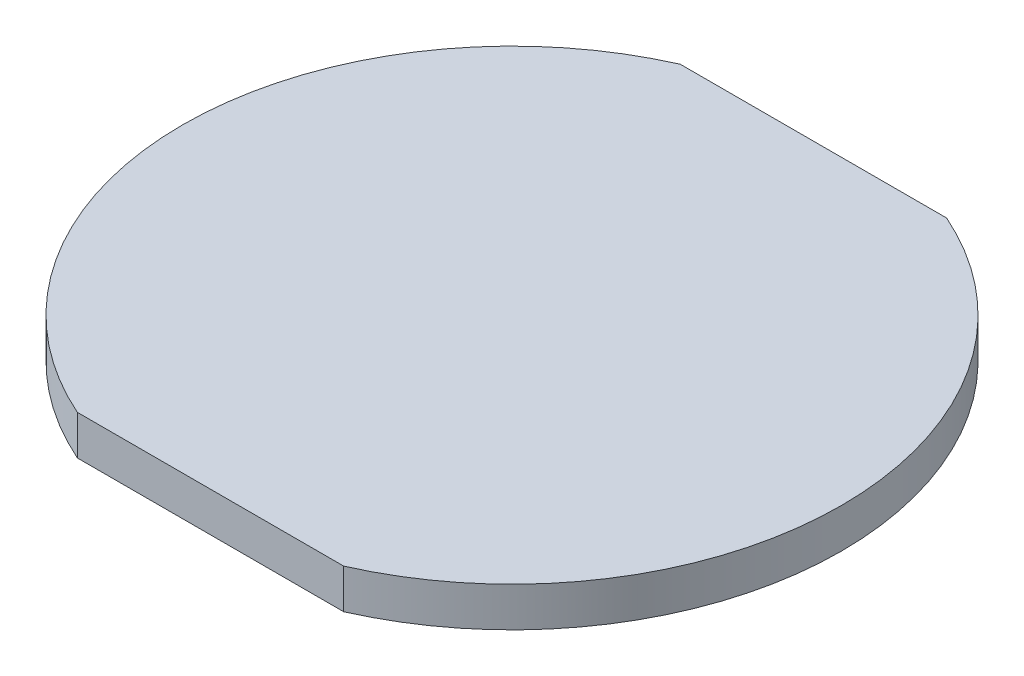
ISO-10303-21;
HEADER;
FILE_DESCRIPTION(('STEP AP214'),'2;1');
FILE_NAME('part.step','',(''),(''),'','','');
FILE_SCHEMA(('AUTOMOTIVE_DESIGN { 1 0 10303 214 1 1 1 1 }'));
ENDSEC;
DATA;
#1=APPLICATION_CONTEXT('core data for automotive mechanical design processes');
#2=APPLICATION_PROTOCOL_DEFINITION('international standard','automotive_design',2000,#1);
#3=PRODUCT_CONTEXT('',#1,'mechanical');
#4=PRODUCT('Part','Part','',(#3));
#5=PRODUCT_RELATED_PRODUCT_CATEGORY('part','',(#4));
#6=PRODUCT_DEFINITION_FORMATION('','',#4);
#7=PRODUCT_DEFINITION_CONTEXT('part definition',#1,'design');
#8=PRODUCT_DEFINITION('design','',#6,#7);
#9=PRODUCT_DEFINITION_SHAPE('','',#8);
#10=(LENGTH_UNIT() NAMED_UNIT(*) SI_UNIT(.MILLI.,.METRE.));
#11=(NAMED_UNIT(*) PLANE_ANGLE_UNIT() SI_UNIT($,.RADIAN.));
#12=(NAMED_UNIT(*) SI_UNIT($,.STERADIAN.) SOLID_ANGLE_UNIT());
#13=UNCERTAINTY_MEASURE_WITH_UNIT(LENGTH_MEASURE(1.E-05),#10,'distance_accuracy_value','');
#14=(GEOMETRIC_REPRESENTATION_CONTEXT(3) GLOBAL_UNCERTAINTY_ASSIGNED_CONTEXT((#13)) GLOBAL_UNIT_ASSIGNED_CONTEXT((#10,
#11,#12)) REPRESENTATION_CONTEXT('',''));
#15=CARTESIAN_POINT('',(0.,0.,0.));
#16=DIRECTION('',(0.,0.,1.));
#17=DIRECTION('',(1.,0.,0.));
#18=AXIS2_PLACEMENT_3D('',#15,#16,#17);
#19=CARTESIAN_POINT('',(0.,3.,0.));
#20=DIRECTION('',(0.,-1.,0.));
#21=DIRECTION('',(0.,0.,-1.));
#22=AXIS2_PLACEMENT_3D('',#19,#20,#21);
#23=CYLINDRICAL_SURFACE('',#22,25.);
#24=CARTESIAN_POINT('',(0.,0.,0.));
#25=DIRECTION('',(0.,1.,0.));
#26=DIRECTION('',(0.,0.,1.));
#27=AXIS2_PLACEMENT_3D('',#24,#25,#26);
#28=CIRCLE('',#27,25.);
#29=CARTESIAN_POINT('',(10.1,0.,22.8689746162787));
#30=VERTEX_POINT('',#29);
#31=CARTESIAN_POINT('',(10.1,0.,-22.8689746162787));
#32=VERTEX_POINT('',#31);
#33=EDGE_CURVE('E95',#30,#32,#28,.T.);
#34=ORIENTED_EDGE('',*,*,#33,.T.);
#35=DIRECTION('',(0.,-1.,0.));
#36=VECTOR('',#35,1.);
#37=CARTESIAN_POINT('',(10.1,3.,-22.8689746162787));
#38=LINE('',#37,#36);
#39=CARTESIAN_POINT('',(10.1,3.,-22.8689746162787));
#40=VERTEX_POINT('',#39);
#41=EDGE_CURVE('E11',#40,#32,#38,.T.);
#42=ORIENTED_EDGE('',*,*,#41,.F.);
#43=CARTESIAN_POINT('',(0.,3.,0.));
#44=DIRECTION('',(0.,1.,0.));
#45=DIRECTION('',(0.,0.,1.));
#46=AXIS2_PLACEMENT_3D('',#43,#44,#45);
#47=CIRCLE('',#46,25.);
#48=CARTESIAN_POINT('',(10.1,3.,22.8689746162787));
#49=VERTEX_POINT('',#48);
#50=EDGE_CURVE('E83',#49,#40,#47,.T.);
#51=ORIENTED_EDGE('',*,*,#50,.F.);
#52=DIRECTION('',(0.,-1.,0.));
#53=VECTOR('',#52,1.);
#54=CARTESIAN_POINT('',(10.1,3.,22.8689746162787));
#55=LINE('',#54,#53);
#56=EDGE_CURVE('E91',#49,#30,#55,.T.);
#57=ORIENTED_EDGE('',*,*,#56,.T.);
#58=EDGE_LOOP('',(#34,#42,#51,#57));
#59=FACE_BOUND('',#58,.T.);
#60=ADVANCED_FACE('F32',(#59),#23,.T.);
#61=CARTESIAN_POINT('',(10.1,3.,-22.8689746162787));
#62=DIRECTION('',(0.,0.,1.));
#63=DIRECTION('',(1.,0.,0.));
#64=AXIS2_PLACEMENT_3D('',#61,#62,#63);
#65=PLANE('',#64);
#66=DIRECTION('',(-1.,0.,0.));
#67=VECTOR('',#66,1.);
#68=CARTESIAN_POINT('',(10.1,0.,-22.8689746162787));
#69=LINE('',#68,#67);
#70=CARTESIAN_POINT('',(-10.1,0.,-22.8689746162787));
#71=VERTEX_POINT('',#70);
#72=EDGE_CURVE('E87',#32,#71,#69,.T.);
#73=ORIENTED_EDGE('',*,*,#72,.T.);
#74=DIRECTION('',(0.,-1.,0.));
#75=VECTOR('',#74,1.);
#76=CARTESIAN_POINT('',(-10.1,3.,-22.8689746162787));
#77=LINE('',#76,#75);
#78=CARTESIAN_POINT('',(-10.1,3.,-22.8689746162787));
#79=VERTEX_POINT('',#78);
#80=EDGE_CURVE('E40',#79,#71,#77,.T.);
#81=ORIENTED_EDGE('',*,*,#80,.F.);
#82=DIRECTION('',(-1.,0.,0.));
#83=VECTOR('',#82,1.);
#84=CARTESIAN_POINT('',(10.1,3.,-22.8689746162787));
#85=LINE('',#84,#83);
#86=EDGE_CURVE('E78',#40,#79,#85,.T.);
#87=ORIENTED_EDGE('',*,*,#86,.F.);
#88=ORIENTED_EDGE('',*,*,#41,.T.);
#89=EDGE_LOOP('',(#73,#81,#87,#88));
#90=FACE_BOUND('',#89,.T.);
#91=ADVANCED_FACE('F86',(#90),#65,.F.);
#92=CARTESIAN_POINT('',(0.,3.,0.));
#93=DIRECTION('',(0.,-1.,0.));
#94=DIRECTION('',(0.,0.,-1.));
#95=AXIS2_PLACEMENT_3D('',#92,#93,#94);
#96=CYLINDRICAL_SURFACE('',#95,25.);
#97=CARTESIAN_POINT('',(0.,0.,0.));
#98=DIRECTION('',(0.,1.,0.));
#99=DIRECTION('',(0.,0.,1.));
#100=AXIS2_PLACEMENT_3D('',#97,#98,#99);
#101=CIRCLE('',#100,25.);
#102=CARTESIAN_POINT('',(-10.1,0.,22.8689746162787));
#103=VERTEX_POINT('',#102);
#104=EDGE_CURVE('E65',#71,#103,#101,.T.);
#105=ORIENTED_EDGE('',*,*,#104,.T.);
#106=DIRECTION('',(0.,-1.,0.));
#107=VECTOR('',#106,1.);
#108=CARTESIAN_POINT('',(-10.1,3.,22.8689746162787));
#109=LINE('',#108,#107);
#110=CARTESIAN_POINT('',(-10.1,3.,22.8689746162787));
#111=VERTEX_POINT('',#110);
#112=EDGE_CURVE('E88',#111,#103,#109,.T.);
#113=ORIENTED_EDGE('',*,*,#112,.F.);
#114=CARTESIAN_POINT('',(0.,3.,0.));
#115=DIRECTION('',(0.,1.,0.));
#116=DIRECTION('',(0.,0.,1.));
#117=AXIS2_PLACEMENT_3D('',#114,#115,#116);
#118=CIRCLE('',#117,25.);
#119=EDGE_CURVE('E81',#79,#111,#118,.T.);
#120=ORIENTED_EDGE('',*,*,#119,.F.);
#121=ORIENTED_EDGE('',*,*,#80,.T.);
#122=EDGE_LOOP('',(#105,#113,#120,#121));
#123=FACE_BOUND('',#122,.T.);
#124=ADVANCED_FACE('F89',(#123),#96,.T.);
#125=CARTESIAN_POINT('',(10.1,3.,22.8689746162787));
#126=DIRECTION('',(0.,0.,-1.));
#127=DIRECTION('',(-1.,0.,0.));
#128=AXIS2_PLACEMENT_3D('',#125,#126,#127);
#129=PLANE('',#128);
#130=DIRECTION('',(1.,0.,0.));
#131=VECTOR('',#130,1.);
#132=CARTESIAN_POINT('',(10.1,0.,22.8689746162787));
#133=LINE('',#132,#131);
#134=EDGE_CURVE('E71',#103,#30,#133,.T.);
#135=ORIENTED_EDGE('',*,*,#134,.T.);
#136=ORIENTED_EDGE('',*,*,#56,.F.);
#137=DIRECTION('',(1.,0.,0.));
#138=VECTOR('',#137,1.);
#139=CARTESIAN_POINT('',(10.1,3.,22.8689746162787));
#140=LINE('',#139,#138);
#141=EDGE_CURVE('E48',#111,#49,#140,.T.);
#142=ORIENTED_EDGE('',*,*,#141,.F.);
#143=ORIENTED_EDGE('',*,*,#112,.T.);
#144=EDGE_LOOP('',(#135,#136,#142,#143));
#145=FACE_BOUND('',#144,.T.);
#146=ADVANCED_FACE('F102',(#145),#129,.F.);
#147=CARTESIAN_POINT('',(0.,3.,0.));
#148=DIRECTION('',(0.,1.,0.));
#149=DIRECTION('',(0.,0.,1.));
#150=AXIS2_PLACEMENT_3D('',#147,#148,#149);
#151=PLANE('',#150);
#152=ORIENTED_EDGE('',*,*,#50,.T.);
#153=ORIENTED_EDGE('',*,*,#86,.T.);
#154=ORIENTED_EDGE('',*,*,#119,.T.);
#155=ORIENTED_EDGE('',*,*,#141,.T.);
#156=EDGE_LOOP('',(#152,#153,#154,#155));
#157=FACE_BOUND('',#156,.T.);
#158=ADVANCED_FACE('F79',(#157),#151,.T.);
#159=CARTESIAN_POINT('',(0.,0.,0.));
#160=DIRECTION('',(0.,1.,0.));
#161=DIRECTION('',(0.,0.,1.));
#162=AXIS2_PLACEMENT_3D('',#159,#160,#161);
#163=PLANE('',#162);
#164=ORIENTED_EDGE('',*,*,#33,.F.);
#165=ORIENTED_EDGE('',*,*,#134,.F.);
#166=ORIENTED_EDGE('',*,*,#104,.F.);
#167=ORIENTED_EDGE('',*,*,#72,.F.);
#168=EDGE_LOOP('',(#164,#165,#166,#167));
#169=FACE_BOUND('',#168,.T.);
#170=ADVANCED_FACE('F105',(#169),#163,.F.);
#171=CLOSED_SHELL('',(#60,#91,#124,#146,#158,#170));
#172=MANIFOLD_SOLID_BREP('B2',#171);
#173=ADVANCED_BREP_SHAPE_REPRESENTATION('',(#18,#172),#14);
#174=SHAPE_DEFINITION_REPRESENTATION(#9,#173);
ENDSEC;
END-ISO-10303-21;
